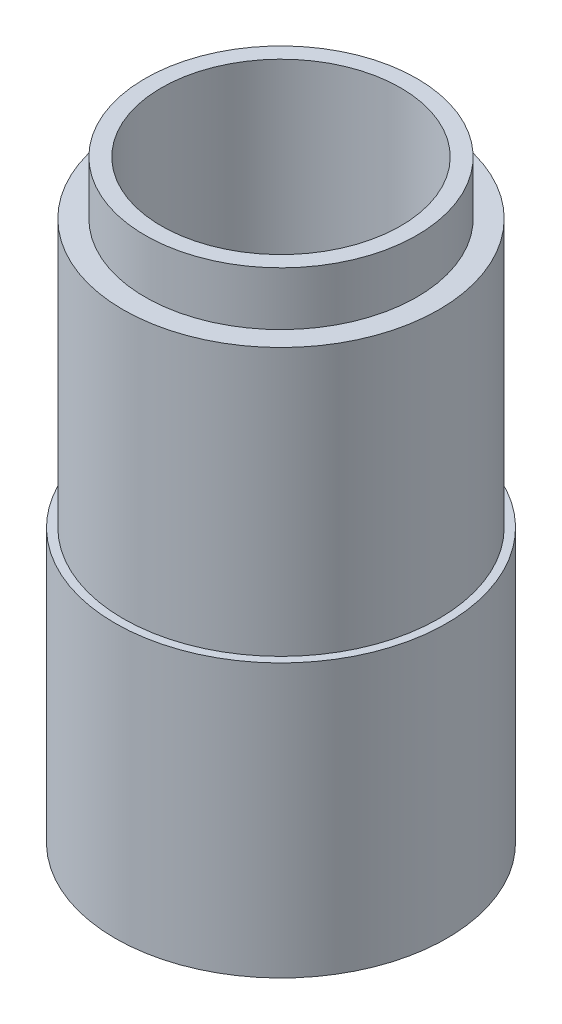
ISO-10303-21;
HEADER;
FILE_DESCRIPTION(('STEP AP214'),'2;1');
FILE_NAME('part.step','',(''),(''),'','','');
FILE_SCHEMA(('AUTOMOTIVE_DESIGN { 1 0 10303 214 1 1 1 1 }'));
ENDSEC;
DATA;
#1=APPLICATION_CONTEXT('core data for automotive mechanical design processes');
#2=APPLICATION_PROTOCOL_DEFINITION('international standard','automotive_design',2000,#1);
#3=PRODUCT_CONTEXT('',#1,'mechanical');
#4=PRODUCT('Part','Part','',(#3));
#5=PRODUCT_RELATED_PRODUCT_CATEGORY('part','',(#4));
#6=PRODUCT_DEFINITION_FORMATION('','',#4);
#7=PRODUCT_DEFINITION_CONTEXT('part definition',#1,'design');
#8=PRODUCT_DEFINITION('design','',#6,#7);
#9=PRODUCT_DEFINITION_SHAPE('','',#8);
#10=(LENGTH_UNIT() NAMED_UNIT(*) SI_UNIT(.MILLI.,.METRE.));
#11=(NAMED_UNIT(*) PLANE_ANGLE_UNIT() SI_UNIT($,.RADIAN.));
#12=(NAMED_UNIT(*) SI_UNIT($,.STERADIAN.) SOLID_ANGLE_UNIT());
#13=UNCERTAINTY_MEASURE_WITH_UNIT(LENGTH_MEASURE(1.E-05),#10,'distance_accuracy_value','');
#14=(GEOMETRIC_REPRESENTATION_CONTEXT(3) GLOBAL_UNCERTAINTY_ASSIGNED_CONTEXT((#13)) GLOBAL_UNIT_ASSIGNED_CONTEXT((#10,
#11,#12)) REPRESENTATION_CONTEXT('',''));
#15=CARTESIAN_POINT('',(0.,0.,0.));
#16=DIRECTION('',(0.,0.,1.));
#17=DIRECTION('',(1.,0.,0.));
#18=AXIS2_PLACEMENT_3D('',#15,#16,#17);
#19=CARTESIAN_POINT('',(0.,0.,0.));
#20=DIRECTION('',(0.,-1.,0.));
#21=DIRECTION('',(0.,0.,-1.));
#22=AXIS2_PLACEMENT_3D('',#19,#20,#21);
#23=CYLINDRICAL_SURFACE('',#22,11.185);
#24=CARTESIAN_POINT('',(0.,5.,0.));
#25=DIRECTION('',(0.,-1.,0.));
#26=DIRECTION('',(0.,0.,-1.));
#27=AXIS2_PLACEMENT_3D('',#24,#25,#26);
#28=CIRCLE('',#27,11.185);
#29=CARTESIAN_POINT('',(0.,5.,-11.185));
#30=VERTEX_POINT('',#29);
#31=EDGE_CURVE('E10',#30,#30,#28,.T.);
#32=ORIENTED_EDGE('',*,*,#31,.T.);
#33=EDGE_LOOP('',(#32));
#34=FACE_BOUND('',#33,.T.);
#35=CARTESIAN_POINT('',(0.,55.5,0.));
#36=DIRECTION('',(0.,-1.,0.));
#37=DIRECTION('',(0.,0.,-1.));
#38=AXIS2_PLACEMENT_3D('',#35,#36,#37);
#39=CIRCLE('',#38,11.185);
#40=CARTESIAN_POINT('',(0.,55.5,-11.185));
#41=VERTEX_POINT('',#40);
#42=EDGE_CURVE('E70',#41,#41,#39,.T.);
#43=ORIENTED_EDGE('',*,*,#42,.F.);
#44=EDGE_LOOP('',(#43));
#45=FACE_BOUND('',#44,.T.);
#46=ADVANCED_FACE('F34',(#34,#45),#23,.F.);
#47=CARTESIAN_POINT('',(9.655,5.,0.));
#48=DIRECTION('',(0.,1.,0.));
#49=DIRECTION('',(0.,0.,1.));
#50=AXIS2_PLACEMENT_3D('',#47,#48,#49);
#51=PLANE('',#50);
#52=CARTESIAN_POINT('',(0.,5.,0.));
#53=DIRECTION('',(0.,-1.,0.));
#54=DIRECTION('',(0.,0.,-1.));
#55=AXIS2_PLACEMENT_3D('',#52,#53,#54);
#56=CIRCLE('',#55,9.655);
#57=CARTESIAN_POINT('',(0.,5.,-9.655));
#58=VERTEX_POINT('',#57);
#59=EDGE_CURVE('E40',#58,#58,#56,.T.);
#60=ORIENTED_EDGE('',*,*,#59,.T.);
#61=EDGE_LOOP('',(#60));
#62=FACE_BOUND('',#61,.T.);
#63=ORIENTED_EDGE('',*,*,#31,.F.);
#64=EDGE_LOOP('',(#63));
#65=FACE_BOUND('',#64,.T.);
#66=ADVANCED_FACE('F79',(#62,#65),#51,.T.);
#67=CARTESIAN_POINT('',(0.,0.,0.));
#68=DIRECTION('',(0.,-1.,0.));
#69=DIRECTION('',(0.,0.,-1.));
#70=AXIS2_PLACEMENT_3D('',#67,#68,#69);
#71=CYLINDRICAL_SURFACE('',#70,9.655);
#72=CARTESIAN_POINT('',(0.,0.,0.));
#73=DIRECTION('',(0.,-1.,0.));
#74=DIRECTION('',(0.,0.,-1.));
#75=AXIS2_PLACEMENT_3D('',#72,#73,#74);
#76=CIRCLE('',#75,9.655);
#77=CARTESIAN_POINT('',(0.,0.,-9.655));
#78=VERTEX_POINT('',#77);
#79=EDGE_CURVE('E44',#78,#78,#76,.T.);
#80=ORIENTED_EDGE('',*,*,#79,.T.);
#81=EDGE_LOOP('',(#80));
#82=FACE_BOUND('',#81,.T.);
#83=ORIENTED_EDGE('',*,*,#59,.F.);
#84=EDGE_LOOP('',(#83));
#85=FACE_BOUND('',#84,.T.);
#86=ADVANCED_FACE('F83',(#82,#85),#71,.F.);
#87=CARTESIAN_POINT('',(9.655,0.,0.));
#88=DIRECTION('',(0.,-1.,0.));
#89=DIRECTION('',(0.,0.,-1.));
#90=AXIS2_PLACEMENT_3D('',#87,#88,#89);
#91=PLANE('',#90);
#92=CARTESIAN_POINT('',(0.,0.,0.));
#93=DIRECTION('',(0.,-1.,0.));
#94=DIRECTION('',(0.,0.,-1.));
#95=AXIS2_PLACEMENT_3D('',#92,#93,#94);
#96=CIRCLE('',#95,15.5);
#97=CARTESIAN_POINT('',(0.,0.,-15.5));
#98=VERTEX_POINT('',#97);
#99=EDGE_CURVE('E48',#98,#98,#96,.T.);
#100=ORIENTED_EDGE('',*,*,#99,.T.);
#101=EDGE_LOOP('',(#100));
#102=FACE_BOUND('',#101,.T.);
#103=ORIENTED_EDGE('',*,*,#79,.F.);
#104=EDGE_LOOP('',(#103));
#105=FACE_BOUND('',#104,.T.);
#106=ADVANCED_FACE('F87',(#102,#105),#91,.T.);
#107=CARTESIAN_POINT('',(0.,0.,0.));
#108=DIRECTION('',(0.,-1.,0.));
#109=DIRECTION('',(0.,0.,-1.));
#110=AXIS2_PLACEMENT_3D('',#107,#108,#109);
#111=CYLINDRICAL_SURFACE('',#110,15.5);
#112=CARTESIAN_POINT('',(0.,25.5,0.));
#113=DIRECTION('',(0.,-1.,0.));
#114=DIRECTION('',(0.,0.,-1.));
#115=AXIS2_PLACEMENT_3D('',#112,#113,#114);
#116=CIRCLE('',#115,15.5);
#117=CARTESIAN_POINT('',(0.,25.5,-15.5));
#118=VERTEX_POINT('',#117);
#119=EDGE_CURVE('E53',#118,#118,#116,.T.);
#120=ORIENTED_EDGE('',*,*,#119,.T.);
#121=EDGE_LOOP('',(#120));
#122=FACE_BOUND('',#121,.T.);
#123=ORIENTED_EDGE('',*,*,#99,.F.);
#124=EDGE_LOOP('',(#123));
#125=FACE_BOUND('',#124,.T.);
#126=ADVANCED_FACE('F94',(#122,#125),#111,.T.);
#127=CARTESIAN_POINT('',(15.5,25.5,0.));
#128=DIRECTION('',(0.,1.,0.));
#129=DIRECTION('',(0.,0.,1.));
#130=AXIS2_PLACEMENT_3D('',#127,#128,#129);
#131=PLANE('',#130);
#132=CARTESIAN_POINT('',(0.,25.5,0.));
#133=DIRECTION('',(0.,-1.,0.));
#134=DIRECTION('',(0.,0.,-1.));
#135=AXIS2_PLACEMENT_3D('',#132,#133,#134);
#136=CIRCLE('',#135,14.75);
#137=CARTESIAN_POINT('',(0.,25.5,-14.75));
#138=VERTEX_POINT('',#137);
#139=EDGE_CURVE('E56',#138,#138,#136,.T.);
#140=ORIENTED_EDGE('',*,*,#139,.T.);
#141=EDGE_LOOP('',(#140));
#142=FACE_BOUND('',#141,.T.);
#143=ORIENTED_EDGE('',*,*,#119,.F.);
#144=EDGE_LOOP('',(#143));
#145=FACE_BOUND('',#144,.T.);
#146=ADVANCED_FACE('F98',(#142,#145),#131,.T.);
#147=CARTESIAN_POINT('',(0.,0.,0.));
#148=DIRECTION('',(0.,-1.,0.));
#149=DIRECTION('',(0.,0.,-1.));
#150=AXIS2_PLACEMENT_3D('',#147,#148,#149);
#151=CYLINDRICAL_SURFACE('',#150,14.75);
#152=CARTESIAN_POINT('',(0.,50.5,0.));
#153=DIRECTION('',(0.,-1.,0.));
#154=DIRECTION('',(0.,0.,-1.));
#155=AXIS2_PLACEMENT_3D('',#152,#153,#154);
#156=CIRCLE('',#155,14.75);
#157=CARTESIAN_POINT('',(0.,50.5,-14.75));
#158=VERTEX_POINT('',#157);
#159=EDGE_CURVE('E59',#158,#158,#156,.T.);
#160=ORIENTED_EDGE('',*,*,#159,.T.);
#161=EDGE_LOOP('',(#160));
#162=FACE_BOUND('',#161,.T.);
#163=ORIENTED_EDGE('',*,*,#139,.F.);
#164=EDGE_LOOP('',(#163));
#165=FACE_BOUND('',#164,.T.);
#166=ADVANCED_FACE('F102',(#162,#165),#151,.T.);
#167=CARTESIAN_POINT('',(14.75,50.5,0.));
#168=DIRECTION('',(0.,1.,0.));
#169=DIRECTION('',(0.,0.,1.));
#170=AXIS2_PLACEMENT_3D('',#167,#168,#169);
#171=PLANE('',#170);
#172=CARTESIAN_POINT('',(0.,50.5,0.));
#173=DIRECTION('',(0.,-1.,0.));
#174=DIRECTION('',(0.,0.,-1.));
#175=AXIS2_PLACEMENT_3D('',#172,#173,#174);
#176=CIRCLE('',#175,12.7);
#177=CARTESIAN_POINT('',(0.,50.5,-12.7));
#178=VERTEX_POINT('',#177);
#179=EDGE_CURVE('E62',#178,#178,#176,.T.);
#180=ORIENTED_EDGE('',*,*,#179,.T.);
#181=EDGE_LOOP('',(#180));
#182=FACE_BOUND('',#181,.T.);
#183=ORIENTED_EDGE('',*,*,#159,.F.);
#184=EDGE_LOOP('',(#183));
#185=FACE_BOUND('',#184,.T.);
#186=ADVANCED_FACE('F106',(#182,#185),#171,.T.);
#187=CARTESIAN_POINT('',(0.,0.,0.));
#188=DIRECTION('',(0.,-1.,0.));
#189=DIRECTION('',(0.,0.,-1.));
#190=AXIS2_PLACEMENT_3D('',#187,#188,#189);
#191=CYLINDRICAL_SURFACE('',#190,12.7);
#192=CARTESIAN_POINT('',(0.,55.5,0.));
#193=DIRECTION('',(0.,-1.,0.));
#194=DIRECTION('',(0.,0.,-1.));
#195=AXIS2_PLACEMENT_3D('',#192,#193,#194);
#196=CIRCLE('',#195,12.7);
#197=CARTESIAN_POINT('',(0.,55.5,-12.7));
#198=VERTEX_POINT('',#197);
#199=EDGE_CURVE('E66',#198,#198,#196,.T.);
#200=ORIENTED_EDGE('',*,*,#199,.T.);
#201=EDGE_LOOP('',(#200));
#202=FACE_BOUND('',#201,.T.);
#203=ORIENTED_EDGE('',*,*,#179,.F.);
#204=EDGE_LOOP('',(#203));
#205=FACE_BOUND('',#204,.T.);
#206=ADVANCED_FACE('F110',(#202,#205),#191,.T.);
#207=CARTESIAN_POINT('',(12.7,55.5,0.));
#208=DIRECTION('',(0.,1.,0.));
#209=DIRECTION('',(0.,0.,1.));
#210=AXIS2_PLACEMENT_3D('',#207,#208,#209);
#211=PLANE('',#210);
#212=ORIENTED_EDGE('',*,*,#42,.T.);
#213=EDGE_LOOP('',(#212));
#214=FACE_BOUND('',#213,.T.);
#215=ORIENTED_EDGE('',*,*,#199,.F.);
#216=EDGE_LOOP('',(#215));
#217=FACE_BOUND('',#216,.T.);
#218=ADVANCED_FACE('F75',(#214,#217),#211,.T.);
#219=CLOSED_SHELL('',(#46,#66,#86,#106,#126,#146,#166,#186,#206,#218));
#220=MANIFOLD_SOLID_BREP('B2',#219);
#221=ADVANCED_BREP_SHAPE_REPRESENTATION('',(#18,#220),#14);
#222=SHAPE_DEFINITION_REPRESENTATION(#9,#221);
ENDSEC;
END-ISO-10303-21;
